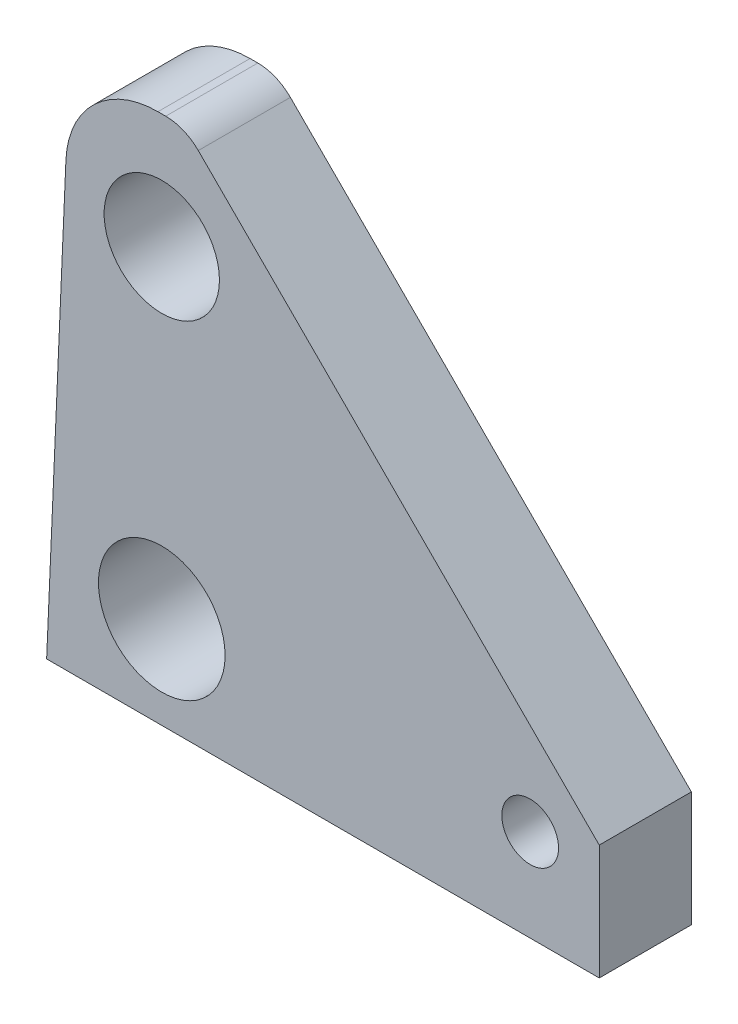
ISO-10303-21;
HEADER;
FILE_DESCRIPTION(('STEP AP214'),'2;1');
FILE_NAME('part.step','',(''),(''),'','','');
FILE_SCHEMA(('AUTOMOTIVE_DESIGN { 1 0 10303 214 1 1 1 1 }'));
ENDSEC;
DATA;
#1=APPLICATION_CONTEXT('core data for automotive mechanical design processes');
#2=APPLICATION_PROTOCOL_DEFINITION('international standard','automotive_design',2000,#1);
#3=PRODUCT_CONTEXT('',#1,'mechanical');
#4=PRODUCT('Part','Part','',(#3));
#5=PRODUCT_RELATED_PRODUCT_CATEGORY('part','',(#4));
#6=PRODUCT_DEFINITION_FORMATION('','',#4);
#7=PRODUCT_DEFINITION_CONTEXT('part definition',#1,'design');
#8=PRODUCT_DEFINITION('design','',#6,#7);
#9=PRODUCT_DEFINITION_SHAPE('','',#8);
#10=(LENGTH_UNIT() NAMED_UNIT(*) SI_UNIT(.MILLI.,.METRE.));
#11=(NAMED_UNIT(*) PLANE_ANGLE_UNIT() SI_UNIT($,.RADIAN.));
#12=(NAMED_UNIT(*) SI_UNIT($,.STERADIAN.) SOLID_ANGLE_UNIT());
#13=UNCERTAINTY_MEASURE_WITH_UNIT(LENGTH_MEASURE(1.E-05),#10,'distance_accuracy_value','');
#14=(GEOMETRIC_REPRESENTATION_CONTEXT(3) GLOBAL_UNCERTAINTY_ASSIGNED_CONTEXT((#13)) GLOBAL_UNIT_ASSIGNED_CONTEXT((#10,
#11,#12)) REPRESENTATION_CONTEXT('',''));
#15=CARTESIAN_POINT('',(0.,0.,0.));
#16=DIRECTION('',(0.,0.,1.));
#17=DIRECTION('',(1.,0.,0.));
#18=AXIS2_PLACEMENT_3D('',#15,#16,#17);
#19=CARTESIAN_POINT('',(19.05,18.25625,6.34999999999999));
#20=DIRECTION('',(0.,0.,-1.));
#21=DIRECTION('',(0.,1.,0.));
#22=AXIS2_PLACEMENT_3D('',#19,#20,#21);
#23=PLANE('',#22);
#24=CARTESIAN_POINT('',(-11.1125,10.31875,6.34999999999999));
#25=DIRECTION('',(0.,0.,1.));
#26=DIRECTION('',(1.,0.,0.));
#27=AXIS2_PLACEMENT_3D('',#24,#25,#26);
#28=CIRCLE('',#27,3.9751);
#29=CARTESIAN_POINT('',(-7.13739999999999,10.31875,6.34999999999999));
#30=VERTEX_POINT('',#29);
#31=EDGE_CURVE('E214',#30,#30,#28,.T.);
#32=ORIENTED_EDGE('',*,*,#31,.F.);
#33=EDGE_LOOP('',(#32));
#34=FACE_BOUND('',#33,.T.);
#35=CARTESIAN_POINT('',(14.2875,-11.90625,6.34999999999999));
#36=DIRECTION('',(0.,0.,1.));
#37=DIRECTION('',(1.,0.,0.));
#38=AXIS2_PLACEMENT_3D('',#35,#36,#37);
#39=CIRCLE('',#38,1.9558);
#40=CARTESIAN_POINT('',(16.2433,-11.90625,6.34999999999999));
#41=VERTEX_POINT('',#40);
#42=EDGE_CURVE('E208',#41,#41,#39,.T.);
#43=ORIENTED_EDGE('',*,*,#42,.F.);
#44=EDGE_LOOP('',(#43));
#45=FACE_BOUND('',#44,.T.);
#46=CARTESIAN_POINT('',(-11.1125,-11.90625,6.34999999999999));
#47=DIRECTION('',(0.,0.,1.));
#48=DIRECTION('',(1.,0.,0.));
#49=AXIS2_PLACEMENT_3D('',#46,#47,#48);
#50=CIRCLE('',#49,4.365625);
#51=CARTESIAN_POINT('',(-6.74687499999999,-11.90625,6.34999999999999));
#52=VERTEX_POINT('',#51);
#53=EDGE_CURVE('E212',#52,#52,#50,.T.);
#54=ORIENTED_EDGE('',*,*,#53,.F.);
#55=EDGE_LOOP('',(#54));
#56=FACE_BOUND('',#55,.T.);
#57=DIRECTION('',(0.707106781186549,-0.707106781186546,0.));
#58=VECTOR('',#57,1.);
#59=CARTESIAN_POINT('',(-9.52500000000012,18.25625,6.34999999999999));
#60=LINE('',#59,#58);
#61=CARTESIAN_POINT('',(-8.5950640302674,17.3263140302673,6.34999999999999));
#62=VERTEX_POINT('',#61);
#63=CARTESIAN_POINT('',(19.05,-10.31875,6.34999999999999));
#64=VERTEX_POINT('',#63);
#65=EDGE_CURVE('E141',#62,#64,#60,.T.);
#66=ORIENTED_EDGE('',*,*,#65,.F.);
#67=CARTESIAN_POINT('',(-10.8401280605347,15.08125,6.34999999999999));
#68=DIRECTION('',(0.,0.,-1.));
#69=DIRECTION('',(0.,1.,0.));
#70=AXIS2_PLACEMENT_3D('',#67,#68,#69);
#71=CIRCLE('',#70,3.175);
#72=CARTESIAN_POINT('',(-10.8401280605347,18.25625,6.34999999999999));
#73=VERTEX_POINT('',#72);
#74=EDGE_CURVE('E58',#62,#73,#71,.F.);
#75=ORIENTED_EDGE('',*,*,#74,.T.);
#76=DIRECTION('',(-1.,0.,0.));
#77=VECTOR('',#76,1.);
#78=CARTESIAN_POINT('',(19.05,18.25625,6.34999999999999));
#79=LINE('',#78,#77);
#80=CARTESIAN_POINT('',(-11.3770272587351,18.25625,6.34999999999999));
#81=VERTEX_POINT('',#80);
#82=EDGE_CURVE('E153',#73,#81,#79,.T.);
#83=ORIENTED_EDGE('',*,*,#82,.T.);
#84=CARTESIAN_POINT('',(-11.3770272587351,11.90625,6.34999999999999));
#85=DIRECTION('',(0.,0.,-1.));
#86=DIRECTION('',(0.,1.,0.));
#87=AXIS2_PLACEMENT_3D('',#84,#85,#86);
#88=CIRCLE('',#87,6.35);
#89=CARTESIAN_POINT('',(-17.7209834657799,12.1832331097698,6.34999999999999));
#90=VERTEX_POINT('',#89);
#91=EDGE_CURVE('E112',#81,#90,#88,.F.);
#92=ORIENTED_EDGE('',*,*,#91,.T.);
#93=DIRECTION('',(0.0436193873653288,0.999048221581858,0.));
#94=VECTOR('',#93,1.);
#95=CARTESIAN_POINT('',(-19.05,-18.25625,6.34999999999999));
#96=LINE('',#95,#94);
#97=CARTESIAN_POINT('',(-19.05,-18.25625,6.34999999999999));
#98=VERTEX_POINT('',#97);
#99=EDGE_CURVE('E96',#98,#90,#96,.T.);
#100=ORIENTED_EDGE('',*,*,#99,.F.);
#101=DIRECTION('',(-1.,0.,0.));
#102=VECTOR('',#101,1.);
#103=CARTESIAN_POINT('',(19.05,-18.25625,6.34999999999999));
#104=LINE('',#103,#102);
#105=CARTESIAN_POINT('',(19.05,-18.25625,6.34999999999999));
#106=VERTEX_POINT('',#105);
#107=EDGE_CURVE('E109',#106,#98,#104,.T.);
#108=ORIENTED_EDGE('',*,*,#107,.F.);
#109=DIRECTION('',(0.,-1.,0.));
#110=VECTOR('',#109,1.);
#111=CARTESIAN_POINT('',(19.05,18.25625,6.34999999999999));
#112=LINE('',#111,#110);
#113=EDGE_CURVE('E104',#64,#106,#112,.T.);
#114=ORIENTED_EDGE('',*,*,#113,.F.);
#115=EDGE_LOOP('',(#66,#75,#83,#92,#100,#108,#114));
#116=FACE_BOUND('',#115,.T.);
#117=ADVANCED_FACE('F36',(#34,#45,#56,#116),#23,.F.);
#118=CARTESIAN_POINT('',(19.05,18.25625,0.));
#119=DIRECTION('',(0.,0.,-1.));
#120=DIRECTION('',(0.,1.,0.));
#121=AXIS2_PLACEMENT_3D('',#118,#119,#120);
#122=PLANE('',#121);
#123=CARTESIAN_POINT('',(-11.1125,10.31875,0.));
#124=DIRECTION('',(0.,0.,-1.));
#125=DIRECTION('',(0.,1.,0.));
#126=AXIS2_PLACEMENT_3D('',#123,#124,#125);
#127=CIRCLE('',#126,3.9751);
#128=CARTESIAN_POINT('',(-11.1125,14.29385,0.));
#129=VERTEX_POINT('',#128);
#130=EDGE_CURVE('E217',#129,#129,#127,.F.);
#131=ORIENTED_EDGE('',*,*,#130,.T.);
#132=EDGE_LOOP('',(#131));
#133=FACE_BOUND('',#132,.T.);
#134=CARTESIAN_POINT('',(14.2875,-11.90625,0.));
#135=DIRECTION('',(0.,0.,-1.));
#136=DIRECTION('',(0.,1.,0.));
#137=AXIS2_PLACEMENT_3D('',#134,#135,#136);
#138=CIRCLE('',#137,1.9558);
#139=CARTESIAN_POINT('',(14.2875,-9.95044999999999,0.));
#140=VERTEX_POINT('',#139);
#141=EDGE_CURVE('E205',#140,#140,#138,.F.);
#142=ORIENTED_EDGE('',*,*,#141,.T.);
#143=EDGE_LOOP('',(#142));
#144=FACE_BOUND('',#143,.T.);
#145=CARTESIAN_POINT('',(-11.1125,-11.90625,0.));
#146=DIRECTION('',(0.,0.,-1.));
#147=DIRECTION('',(0.,1.,0.));
#148=AXIS2_PLACEMENT_3D('',#145,#146,#147);
#149=CIRCLE('',#148,4.365625);
#150=CARTESIAN_POINT('',(-11.1125,-7.540625,0.));
#151=VERTEX_POINT('',#150);
#152=EDGE_CURVE('E209',#151,#151,#149,.F.);
#153=ORIENTED_EDGE('',*,*,#152,.T.);
#154=EDGE_LOOP('',(#153));
#155=FACE_BOUND('',#154,.T.);
#156=DIRECTION('',(-1.,0.,0.));
#157=VECTOR('',#156,1.);
#158=CARTESIAN_POINT('',(19.05,18.25625,0.));
#159=LINE('',#158,#157);
#160=CARTESIAN_POINT('',(-10.8401280605347,18.25625,0.));
#161=VERTEX_POINT('',#160);
#162=CARTESIAN_POINT('',(-11.3770272587351,18.25625,0.));
#163=VERTEX_POINT('',#162);
#164=EDGE_CURVE('E123',#161,#163,#159,.T.);
#165=ORIENTED_EDGE('',*,*,#164,.F.);
#166=CARTESIAN_POINT('',(-10.8401280605347,15.08125,0.));
#167=DIRECTION('',(0.,0.,-1.));
#168=DIRECTION('',(0.,1.,0.));
#169=AXIS2_PLACEMENT_3D('',#166,#167,#168);
#170=CIRCLE('',#169,3.175);
#171=CARTESIAN_POINT('',(-8.5950640302674,17.3263140302673,0.));
#172=VERTEX_POINT('',#171);
#173=EDGE_CURVE('E11',#161,#172,#170,.T.);
#174=ORIENTED_EDGE('',*,*,#173,.T.);
#175=DIRECTION('',(0.707106781186549,-0.707106781186546,0.));
#176=VECTOR('',#175,1.);
#177=CARTESIAN_POINT('',(-9.52500000000012,18.25625,0.));
#178=LINE('',#177,#176);
#179=CARTESIAN_POINT('',(19.05,-10.31875,0.));
#180=VERTEX_POINT('',#179);
#181=EDGE_CURVE('E113',#172,#180,#178,.T.);
#182=ORIENTED_EDGE('',*,*,#181,.T.);
#183=DIRECTION('',(0.,-1.,0.));
#184=VECTOR('',#183,1.);
#185=CARTESIAN_POINT('',(19.05,18.25625,0.));
#186=LINE('',#185,#184);
#187=CARTESIAN_POINT('',(19.05,-18.25625,0.));
#188=VERTEX_POINT('',#187);
#189=EDGE_CURVE('E152',#180,#188,#186,.T.);
#190=ORIENTED_EDGE('',*,*,#189,.T.);
#191=DIRECTION('',(-1.,0.,0.));
#192=VECTOR('',#191,1.);
#193=CARTESIAN_POINT('',(19.05,-18.25625,0.));
#194=LINE('',#193,#192);
#195=CARTESIAN_POINT('',(-19.05,-18.25625,0.));
#196=VERTEX_POINT('',#195);
#197=EDGE_CURVE('E119',#188,#196,#194,.T.);
#198=ORIENTED_EDGE('',*,*,#197,.T.);
#199=DIRECTION('',(0.0436193873653288,0.999048221581858,0.));
#200=VECTOR('',#199,1.);
#201=CARTESIAN_POINT('',(-19.05,-18.25625,0.));
#202=LINE('',#201,#200);
#203=CARTESIAN_POINT('',(-17.7209834657799,12.1832331097698,0.));
#204=VERTEX_POINT('',#203);
#205=EDGE_CURVE('E99',#196,#204,#202,.T.);
#206=ORIENTED_EDGE('',*,*,#205,.T.);
#207=CARTESIAN_POINT('',(-11.3770272587351,11.90625,0.));
#208=DIRECTION('',(0.,0.,-1.));
#209=DIRECTION('',(0.,1.,0.));
#210=AXIS2_PLACEMENT_3D('',#207,#208,#209);
#211=CIRCLE('',#210,6.35);
#212=EDGE_CURVE('E130',#204,#163,#211,.T.);
#213=ORIENTED_EDGE('',*,*,#212,.T.);
#214=EDGE_LOOP('',(#165,#174,#182,#190,#198,#206,#213));
#215=FACE_BOUND('',#214,.T.);
#216=ADVANCED_FACE('F159',(#133,#144,#155,#215),#122,.T.);
#217=CARTESIAN_POINT('',(19.05,18.25625,6.34999999999999));
#218=DIRECTION('',(0.,1.,0.));
#219=DIRECTION('',(0.,0.,1.));
#220=AXIS2_PLACEMENT_3D('',#217,#218,#219);
#221=PLANE('',#220);
#222=ORIENTED_EDGE('',*,*,#82,.F.);
#223=DIRECTION('',(0.,0.,1.));
#224=VECTOR('',#223,1.);
#225=CARTESIAN_POINT('',(-10.8401280605347,18.25625,6.34999999999999));
#226=LINE('',#225,#224);
#227=EDGE_CURVE('E44',#73,#161,#226,.F.);
#228=ORIENTED_EDGE('',*,*,#227,.T.);
#229=ORIENTED_EDGE('',*,*,#164,.T.);
#230=DIRECTION('',(0.,0.,1.));
#231=VECTOR('',#230,1.);
#232=CARTESIAN_POINT('',(-11.3770272587351,18.25625,6.34999999999999));
#233=LINE('',#232,#231);
#234=EDGE_CURVE('E118',#163,#81,#233,.T.);
#235=ORIENTED_EDGE('',*,*,#234,.T.);
#236=EDGE_LOOP('',(#222,#228,#229,#235));
#237=FACE_BOUND('',#236,.T.);
#238=ADVANCED_FACE('F155',(#237),#221,.T.);
#239=CARTESIAN_POINT('',(19.05,-18.25625,6.34999999999999));
#240=DIRECTION('',(-1.,0.,0.));
#241=DIRECTION('',(0.,0.,1.));
#242=AXIS2_PLACEMENT_3D('',#239,#240,#241);
#243=PLANE('',#242);
#244=DIRECTION('',(0.,0.,-1.));
#245=VECTOR('',#244,1.);
#246=CARTESIAN_POINT('',(19.05,-10.31875,0.));
#247=LINE('',#246,#245);
#248=EDGE_CURVE('E105',#180,#64,#247,.F.);
#249=ORIENTED_EDGE('',*,*,#248,.T.);
#250=ORIENTED_EDGE('',*,*,#113,.T.);
#251=DIRECTION('',(0.,0.,1.));
#252=VECTOR('',#251,1.);
#253=CARTESIAN_POINT('',(19.05,-18.25625,0.));
#254=LINE('',#253,#252);
#255=EDGE_CURVE('E117',#188,#106,#254,.T.);
#256=ORIENTED_EDGE('',*,*,#255,.F.);
#257=ORIENTED_EDGE('',*,*,#189,.F.);
#258=EDGE_LOOP('',(#249,#250,#256,#257));
#259=FACE_BOUND('',#258,.T.);
#260=ADVANCED_FACE('F183',(#259),#243,.F.);
#261=CARTESIAN_POINT('',(19.05,-18.25625,0.));
#262=DIRECTION('',(0.,-1.,0.));
#263=DIRECTION('',(0.,0.,-1.));
#264=AXIS2_PLACEMENT_3D('',#261,#262,#263);
#265=PLANE('',#264);
#266=DIRECTION('',(0.,0.,1.));
#267=VECTOR('',#266,1.);
#268=CARTESIAN_POINT('',(-19.05,-18.25625,0.));
#269=LINE('',#268,#267);
#270=EDGE_CURVE('E93',#196,#98,#269,.T.);
#271=ORIENTED_EDGE('',*,*,#270,.F.);
#272=ORIENTED_EDGE('',*,*,#197,.F.);
#273=ORIENTED_EDGE('',*,*,#255,.T.);
#274=ORIENTED_EDGE('',*,*,#107,.T.);
#275=EDGE_LOOP('',(#271,#272,#273,#274));
#276=FACE_BOUND('',#275,.T.);
#277=ADVANCED_FACE('F115',(#276),#265,.T.);
#278=CARTESIAN_POINT('',(-9.52500000000012,18.25625,0.));
#279=DIRECTION('',(0.707106781186546,0.707106781186549,0.));
#280=DIRECTION('',(0.707106781186549,-0.707106781186546,0.));
#281=AXIS2_PLACEMENT_3D('',#278,#279,#280);
#282=PLANE('',#281);
#283=ORIENTED_EDGE('',*,*,#181,.F.);
#284=DIRECTION('',(0.,0.,1.));
#285=VECTOR('',#284,1.);
#286=CARTESIAN_POINT('',(-8.5950640302674,17.3263140302673,0.));
#287=LINE('',#286,#285);
#288=EDGE_CURVE('E133',#172,#62,#287,.T.);
#289=ORIENTED_EDGE('',*,*,#288,.T.);
#290=ORIENTED_EDGE('',*,*,#65,.T.);
#291=ORIENTED_EDGE('',*,*,#248,.F.);
#292=EDGE_LOOP('',(#283,#289,#290,#291));
#293=FACE_BOUND('',#292,.T.);
#294=ADVANCED_FACE('F139',(#293),#282,.T.);
#295=CARTESIAN_POINT('',(-19.05,-18.25625,0.));
#296=DIRECTION('',(-0.999048221581858,0.0436193873653287,0.));
#297=DIRECTION('',(0.0436193873653288,0.999048221581858,0.));
#298=AXIS2_PLACEMENT_3D('',#295,#296,#297);
#299=PLANE('',#298);
#300=ORIENTED_EDGE('',*,*,#99,.T.);
#301=DIRECTION('',(0.,0.,1.));
#302=VECTOR('',#301,1.);
#303=CARTESIAN_POINT('',(-17.7209834657799,12.1832331097698,0.));
#304=LINE('',#303,#302);
#305=EDGE_CURVE('E128',#90,#204,#304,.F.);
#306=ORIENTED_EDGE('',*,*,#305,.T.);
#307=ORIENTED_EDGE('',*,*,#205,.F.);
#308=ORIENTED_EDGE('',*,*,#270,.T.);
#309=EDGE_LOOP('',(#300,#306,#307,#308));
#310=FACE_BOUND('',#309,.T.);
#311=ADVANCED_FACE('F95',(#310),#299,.T.);
#312=CARTESIAN_POINT('',(-11.1125,-11.90625,-0.00100000000000707));
#313=DIRECTION('',(0.,0.,1.));
#314=DIRECTION('',(1.,0.,0.));
#315=AXIS2_PLACEMENT_3D('',#312,#313,#314);
#316=CYLINDRICAL_SURFACE('',#315,4.365625);
#317=ORIENTED_EDGE('',*,*,#152,.F.);
#318=EDGE_LOOP('',(#317));
#319=FACE_BOUND('',#318,.T.);
#320=ORIENTED_EDGE('',*,*,#53,.T.);
#321=EDGE_LOOP('',(#320));
#322=FACE_BOUND('',#321,.T.);
#323=ADVANCED_FACE('F194',(#319,#322),#316,.F.);
#324=CARTESIAN_POINT('',(14.2875,-11.90625,-0.00100000000000707));
#325=DIRECTION('',(0.,0.,1.));
#326=DIRECTION('',(1.,0.,0.));
#327=AXIS2_PLACEMENT_3D('',#324,#325,#326);
#328=CYLINDRICAL_SURFACE('',#327,1.9558);
#329=ORIENTED_EDGE('',*,*,#141,.F.);
#330=EDGE_LOOP('',(#329));
#331=FACE_BOUND('',#330,.T.);
#332=ORIENTED_EDGE('',*,*,#42,.T.);
#333=EDGE_LOOP('',(#332));
#334=FACE_BOUND('',#333,.T.);
#335=ADVANCED_FACE('F168',(#331,#334),#328,.F.);
#336=CARTESIAN_POINT('',(-11.1125,10.31875,-0.00100000000000707));
#337=DIRECTION('',(0.,0.,1.));
#338=DIRECTION('',(1.,0.,0.));
#339=AXIS2_PLACEMENT_3D('',#336,#337,#338);
#340=CYLINDRICAL_SURFACE('',#339,3.9751);
#341=ORIENTED_EDGE('',*,*,#130,.F.);
#342=EDGE_LOOP('',(#341));
#343=FACE_BOUND('',#342,.T.);
#344=ORIENTED_EDGE('',*,*,#31,.T.);
#345=EDGE_LOOP('',(#344));
#346=FACE_BOUND('',#345,.T.);
#347=ADVANCED_FACE('F163',(#343,#346),#340,.F.);
#348=CARTESIAN_POINT('',(-11.3770272587351,11.90625,6.34999999999999));
#349=DIRECTION('',(0.,0.,1.));
#350=DIRECTION('',(1.,0.,0.));
#351=AXIS2_PLACEMENT_3D('',#348,#349,#350);
#352=CYLINDRICAL_SURFACE('',#351,6.35);
#353=ORIENTED_EDGE('',*,*,#212,.F.);
#354=ORIENTED_EDGE('',*,*,#305,.F.);
#355=ORIENTED_EDGE('',*,*,#91,.F.);
#356=ORIENTED_EDGE('',*,*,#234,.F.);
#357=EDGE_LOOP('',(#353,#354,#355,#356));
#358=FACE_BOUND('',#357,.T.);
#359=ADVANCED_FACE('F161',(#358),#352,.T.);
#360=CARTESIAN_POINT('',(-10.8401280605347,15.08125,0.));
#361=DIRECTION('',(0.,0.,1.));
#362=DIRECTION('',(1.,0.,0.));
#363=AXIS2_PLACEMENT_3D('',#360,#361,#362);
#364=CYLINDRICAL_SURFACE('',#363,3.175);
#365=ORIENTED_EDGE('',*,*,#173,.F.);
#366=ORIENTED_EDGE('',*,*,#227,.F.);
#367=ORIENTED_EDGE('',*,*,#74,.F.);
#368=ORIENTED_EDGE('',*,*,#288,.F.);
#369=EDGE_LOOP('',(#365,#366,#367,#368));
#370=FACE_BOUND('',#369,.T.);
#371=ADVANCED_FACE('F38',(#370),#364,.T.);
#372=CLOSED_SHELL('',(#117,#216,#238,#260,#277,#294,#311,#323,#335,#347,#359,#371));
#373=MANIFOLD_SOLID_BREP('B2',#372);
#374=ADVANCED_BREP_SHAPE_REPRESENTATION('',(#18,#373),#14);
#375=SHAPE_DEFINITION_REPRESENTATION(#9,#374);
ENDSEC;
END-ISO-10303-21;
